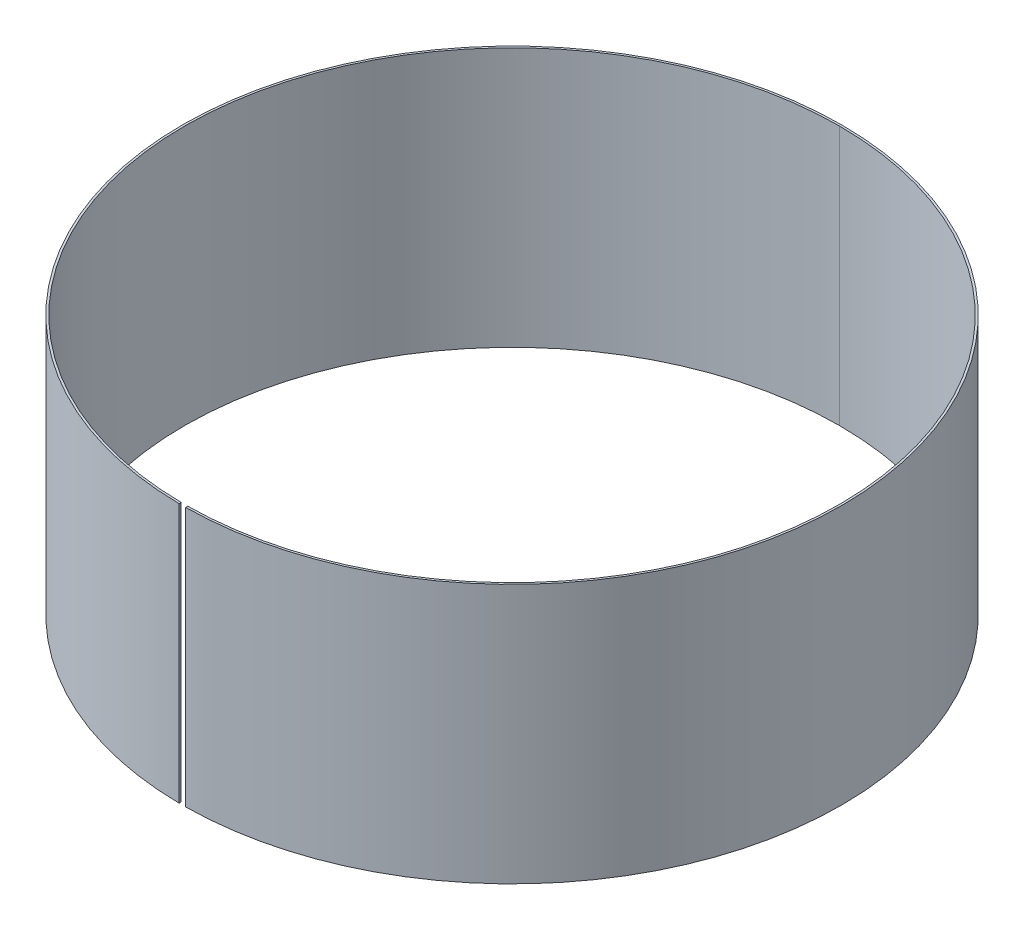
ISO-10303-21;
HEADER;
FILE_DESCRIPTION(('STEP AP214'),'2;1');
FILE_NAME('part.step','',(''),(''),'','','');
FILE_SCHEMA(('AUTOMOTIVE_DESIGN { 1 0 10303 214 1 1 1 1 }'));
ENDSEC;
DATA;
#1=APPLICATION_CONTEXT('core data for automotive mechanical design processes');
#2=APPLICATION_PROTOCOL_DEFINITION('international standard','automotive_design',2000,#1);
#3=PRODUCT_CONTEXT('',#1,'mechanical');
#4=PRODUCT('Part','Part','',(#3));
#5=PRODUCT_RELATED_PRODUCT_CATEGORY('part','',(#4));
#6=PRODUCT_DEFINITION_FORMATION('','',#4);
#7=PRODUCT_DEFINITION_CONTEXT('part definition',#1,'design');
#8=PRODUCT_DEFINITION('design','',#6,#7);
#9=PRODUCT_DEFINITION_SHAPE('','',#8);
#10=(LENGTH_UNIT() NAMED_UNIT(*) SI_UNIT(.MILLI.,.METRE.));
#11=(NAMED_UNIT(*) PLANE_ANGLE_UNIT() SI_UNIT($,.RADIAN.));
#12=(NAMED_UNIT(*) SI_UNIT($,.STERADIAN.) SOLID_ANGLE_UNIT());
#13=UNCERTAINTY_MEASURE_WITH_UNIT(LENGTH_MEASURE(1.E-05),#10,'distance_accuracy_value','');
#14=(GEOMETRIC_REPRESENTATION_CONTEXT(3) GLOBAL_UNCERTAINTY_ASSIGNED_CONTEXT((#13)) GLOBAL_UNIT_ASSIGNED_CONTEXT((#10,
#11,#12)) REPRESENTATION_CONTEXT('',''));
#15=CARTESIAN_POINT('',(0.,0.,0.));
#16=DIRECTION('',(0.,0.,1.));
#17=DIRECTION('',(1.,0.,0.));
#18=AXIS2_PLACEMENT_3D('',#15,#16,#17);
#19=CARTESIAN_POINT('',(0.,198.,0.));
#20=DIRECTION('',(0.,-1.,0.));
#21=DIRECTION('',(0.,0.,-1.));
#22=AXIS2_PLACEMENT_3D('',#19,#20,#21);
#23=CYLINDRICAL_SURFACE('',#22,250.);
#24=CARTESIAN_POINT('',(0.,198.,0.));
#25=DIRECTION('',(0.,1.,0.));
#26=DIRECTION('',(0.,0.,1.));
#27=AXIS2_PLACEMENT_3D('',#24,#25,#26);
#28=CIRCLE('',#27,250.);
#29=CARTESIAN_POINT('',(2.5,198.,249.987499687485));
#30=VERTEX_POINT('',#29);
#31=CARTESIAN_POINT('',(0.,198.,-250.));
#32=VERTEX_POINT('',#31);
#33=EDGE_CURVE('E11',#30,#32,#28,.T.);
#34=ORIENTED_EDGE('',*,*,#33,.T.);
#35=DIRECTION('',(0.,-1.,0.));
#36=VECTOR('',#35,1.);
#37=CARTESIAN_POINT('',(0.,198.,-250.));
#38=LINE('',#37,#36);
#39=CARTESIAN_POINT('',(0.,0.,-250.));
#40=VERTEX_POINT('',#39);
#41=EDGE_CURVE('E27',#32,#40,#38,.T.);
#42=ORIENTED_EDGE('',*,*,#41,.T.);
#43=CARTESIAN_POINT('',(0.,0.,0.));
#44=DIRECTION('',(0.,1.,0.));
#45=DIRECTION('',(0.,0.,1.));
#46=AXIS2_PLACEMENT_3D('',#43,#44,#45);
#47=CIRCLE('',#46,250.);
#48=CARTESIAN_POINT('',(2.5,0.,249.987499687485));
#49=VERTEX_POINT('',#48);
#50=EDGE_CURVE('E127',#49,#40,#47,.T.);
#51=ORIENTED_EDGE('',*,*,#50,.F.);
#52=DIRECTION('',(0.,-1.,0.));
#53=VECTOR('',#52,1.);
#54=CARTESIAN_POINT('',(2.5,198.,249.987499687485));
#55=LINE('',#54,#53);
#56=EDGE_CURVE('E20',#30,#49,#55,.T.);
#57=ORIENTED_EDGE('',*,*,#56,.F.);
#58=EDGE_LOOP('',(#34,#42,#51,#57));
#59=FACE_BOUND('',#58,.T.);
#60=ADVANCED_FACE('F16',(#59),#23,.F.);
#61=CARTESIAN_POINT('',(0.,198.,0.));
#62=DIRECTION('',(0.,-1.,0.));
#63=DIRECTION('',(0.,0.,-1.));
#64=AXIS2_PLACEMENT_3D('',#61,#62,#63);
#65=CYLINDRICAL_SURFACE('',#64,251.6);
#66=CARTESIAN_POINT('',(0.,198.,0.));
#67=DIRECTION('',(0.,1.,0.));
#68=DIRECTION('',(0.,0.,1.));
#69=AXIS2_PLACEMENT_3D('',#66,#67,#68);
#70=CIRCLE('',#69,251.6);
#71=CARTESIAN_POINT('',(0.,198.,-251.6));
#72=VERTEX_POINT('',#71);
#73=CARTESIAN_POINT('',(-2.5,198.,251.587579184665));
#74=VERTEX_POINT('',#73);
#75=EDGE_CURVE('E84',#72,#74,#70,.T.);
#76=ORIENTED_EDGE('',*,*,#75,.F.);
#77=DIRECTION('',(0.,-1.,0.));
#78=VECTOR('',#77,1.);
#79=CARTESIAN_POINT('',(0.,198.,-251.6));
#80=LINE('',#79,#78);
#81=CARTESIAN_POINT('',(0.,0.,-251.6));
#82=VERTEX_POINT('',#81);
#83=EDGE_CURVE('E100',#72,#82,#80,.T.);
#84=ORIENTED_EDGE('',*,*,#83,.T.);
#85=CARTESIAN_POINT('',(0.,0.,0.));
#86=DIRECTION('',(0.,1.,0.));
#87=DIRECTION('',(0.,0.,1.));
#88=AXIS2_PLACEMENT_3D('',#85,#86,#87);
#89=CIRCLE('',#88,251.6);
#90=CARTESIAN_POINT('',(-2.5,0.,251.587579184665));
#91=VERTEX_POINT('',#90);
#92=EDGE_CURVE('E133',#82,#91,#89,.T.);
#93=ORIENTED_EDGE('',*,*,#92,.T.);
#94=DIRECTION('',(0.,1.,0.));
#95=VECTOR('',#94,1.);
#96=CARTESIAN_POINT('',(-2.5,198.,251.587579184665));
#97=LINE('',#96,#95);
#98=EDGE_CURVE('E110',#91,#74,#97,.T.);
#99=ORIENTED_EDGE('',*,*,#98,.T.);
#100=EDGE_LOOP('',(#76,#84,#93,#99));
#101=FACE_BOUND('',#100,.T.);
#102=ADVANCED_FACE('F180',(#101),#65,.T.);
#103=CARTESIAN_POINT('',(0.,198.,0.));
#104=DIRECTION('',(0.,-1.,0.));
#105=DIRECTION('',(0.,0.,-1.));
#106=AXIS2_PLACEMENT_3D('',#103,#104,#105);
#107=CYLINDRICAL_SURFACE('',#106,251.6);
#108=ORIENTED_EDGE('',*,*,#83,.F.);
#109=CARTESIAN_POINT('',(0.,198.,0.));
#110=DIRECTION('',(0.,1.,0.));
#111=DIRECTION('',(0.,0.,1.));
#112=AXIS2_PLACEMENT_3D('',#109,#110,#111);
#113=CIRCLE('',#112,251.6);
#114=CARTESIAN_POINT('',(2.5,198.,251.587579184665));
#115=VERTEX_POINT('',#114);
#116=EDGE_CURVE('E93',#115,#72,#113,.T.);
#117=ORIENTED_EDGE('',*,*,#116,.F.);
#118=DIRECTION('',(0.,-1.,0.));
#119=VECTOR('',#118,1.);
#120=CARTESIAN_POINT('',(2.5,198.,251.587579184665));
#121=LINE('',#120,#119);
#122=CARTESIAN_POINT('',(2.5,0.,251.587579184665));
#123=VERTEX_POINT('',#122);
#124=EDGE_CURVE('E97',#115,#123,#121,.T.);
#125=ORIENTED_EDGE('',*,*,#124,.T.);
#126=CARTESIAN_POINT('',(0.,0.,0.));
#127=DIRECTION('',(0.,1.,0.));
#128=DIRECTION('',(0.,0.,1.));
#129=AXIS2_PLACEMENT_3D('',#126,#127,#128);
#130=CIRCLE('',#129,251.6);
#131=EDGE_CURVE('E111',#123,#82,#130,.T.);
#132=ORIENTED_EDGE('',*,*,#131,.T.);
#133=EDGE_LOOP('',(#108,#117,#125,#132));
#134=FACE_BOUND('',#133,.T.);
#135=ADVANCED_FACE('F95',(#134),#107,.T.);
#136=CARTESIAN_POINT('',(0.,198.,0.));
#137=DIRECTION('',(0.,1.,0.));
#138=DIRECTION('',(1.,0.,0.));
#139=AXIS2_PLACEMENT_3D('',#136,#137,#138);
#140=PLANE('',#139);
#141=DIRECTION('',(0.,0.,1.));
#142=VECTOR('',#141,1.);
#143=CARTESIAN_POINT('',(2.5,198.,255.449352929011));
#144=LINE('',#143,#142);
#145=EDGE_CURVE('E103',#30,#115,#144,.T.);
#146=ORIENTED_EDGE('',*,*,#145,.T.);
#147=ORIENTED_EDGE('',*,*,#116,.T.);
#148=ORIENTED_EDGE('',*,*,#75,.T.);
#149=DIRECTION('',(0.,0.,-1.));
#150=VECTOR('',#149,1.);
#151=CARTESIAN_POINT('',(-2.5,198.,255.449352929011));
#152=LINE('',#151,#150);
#153=CARTESIAN_POINT('',(-2.5,198.,249.987499687485));
#154=VERTEX_POINT('',#153);
#155=EDGE_CURVE('E130',#74,#154,#152,.T.);
#156=ORIENTED_EDGE('',*,*,#155,.T.);
#157=CARTESIAN_POINT('',(0.,198.,0.));
#158=DIRECTION('',(0.,1.,0.));
#159=DIRECTION('',(0.,0.,1.));
#160=AXIS2_PLACEMENT_3D('',#157,#158,#159);
#161=CIRCLE('',#160,250.);
#162=EDGE_CURVE('E153',#32,#154,#161,.T.);
#163=ORIENTED_EDGE('',*,*,#162,.F.);
#164=ORIENTED_EDGE('',*,*,#33,.F.);
#165=EDGE_LOOP('',(#146,#147,#148,#156,#163,#164));
#166=FACE_BOUND('',#165,.T.);
#167=ADVANCED_FACE('F114',(#166),#140,.T.);
#168=CARTESIAN_POINT('',(0.,0.,0.));
#169=DIRECTION('',(0.,1.,0.));
#170=DIRECTION('',(1.,0.,0.));
#171=AXIS2_PLACEMENT_3D('',#168,#169,#170);
#172=PLANE('',#171);
#173=ORIENTED_EDGE('',*,*,#131,.F.);
#174=DIRECTION('',(0.,0.,1.));
#175=VECTOR('',#174,1.);
#176=CARTESIAN_POINT('',(2.5,0.,255.449352929011));
#177=LINE('',#176,#175);
#178=EDGE_CURVE('E108',#49,#123,#177,.T.);
#179=ORIENTED_EDGE('',*,*,#178,.F.);
#180=ORIENTED_EDGE('',*,*,#50,.T.);
#181=CARTESIAN_POINT('',(0.,0.,0.));
#182=DIRECTION('',(0.,1.,0.));
#183=DIRECTION('',(0.,0.,1.));
#184=AXIS2_PLACEMENT_3D('',#181,#182,#183);
#185=CIRCLE('',#184,250.);
#186=CARTESIAN_POINT('',(-2.5,0.,249.987499687485));
#187=VERTEX_POINT('',#186);
#188=EDGE_CURVE('E131',#40,#187,#185,.T.);
#189=ORIENTED_EDGE('',*,*,#188,.T.);
#190=DIRECTION('',(0.,0.,-1.));
#191=VECTOR('',#190,1.);
#192=CARTESIAN_POINT('',(-2.5,0.,255.449352929011));
#193=LINE('',#192,#191);
#194=EDGE_CURVE('E150',#91,#187,#193,.T.);
#195=ORIENTED_EDGE('',*,*,#194,.F.);
#196=ORIENTED_EDGE('',*,*,#92,.F.);
#197=EDGE_LOOP('',(#173,#179,#180,#189,#195,#196));
#198=FACE_BOUND('',#197,.T.);
#199=ADVANCED_FACE('F176',(#198),#172,.F.);
#200=CARTESIAN_POINT('',(0.,198.,0.));
#201=DIRECTION('',(0.,-1.,0.));
#202=DIRECTION('',(0.,0.,-1.));
#203=AXIS2_PLACEMENT_3D('',#200,#201,#202);
#204=CYLINDRICAL_SURFACE('',#203,250.);
#205=ORIENTED_EDGE('',*,*,#41,.F.);
#206=ORIENTED_EDGE('',*,*,#162,.T.);
#207=DIRECTION('',(0.,1.,0.));
#208=VECTOR('',#207,1.);
#209=CARTESIAN_POINT('',(-2.5,198.,249.987499687485));
#210=LINE('',#209,#208);
#211=EDGE_CURVE('E146',#187,#154,#210,.T.);
#212=ORIENTED_EDGE('',*,*,#211,.F.);
#213=ORIENTED_EDGE('',*,*,#188,.F.);
#214=EDGE_LOOP('',(#205,#206,#212,#213));
#215=FACE_BOUND('',#214,.T.);
#216=ADVANCED_FACE('F177',(#215),#204,.F.);
#217=CARTESIAN_POINT('',(-2.5,198.,255.449352929011));
#218=DIRECTION('',(-1.,0.,0.));
#219=DIRECTION('',(0.,0.,1.));
#220=AXIS2_PLACEMENT_3D('',#217,#218,#219);
#221=PLANE('',#220);
#222=ORIENTED_EDGE('',*,*,#194,.T.);
#223=ORIENTED_EDGE('',*,*,#211,.T.);
#224=ORIENTED_EDGE('',*,*,#155,.F.);
#225=ORIENTED_EDGE('',*,*,#98,.F.);
#226=EDGE_LOOP('',(#222,#223,#224,#225));
#227=FACE_BOUND('',#226,.T.);
#228=ADVANCED_FACE('F179',(#227),#221,.F.);
#229=CARTESIAN_POINT('',(2.5,198.,255.449352929011));
#230=DIRECTION('',(1.,0.,0.));
#231=DIRECTION('',(0.,0.,1.));
#232=AXIS2_PLACEMENT_3D('',#229,#230,#231);
#233=PLANE('',#232);
#234=ORIENTED_EDGE('',*,*,#145,.F.);
#235=ORIENTED_EDGE('',*,*,#56,.T.);
#236=ORIENTED_EDGE('',*,*,#178,.T.);
#237=ORIENTED_EDGE('',*,*,#124,.F.);
#238=EDGE_LOOP('',(#234,#235,#236,#237));
#239=FACE_BOUND('',#238,.T.);
#240=ADVANCED_FACE('F18',(#239),#233,.F.);
#241=CLOSED_SHELL('',(#60,#102,#135,#167,#199,#216,#228,#240));
#242=MANIFOLD_SOLID_BREP('B1',#241);
#243=ADVANCED_BREP_SHAPE_REPRESENTATION('',(#18,#242),#14);
#244=SHAPE_DEFINITION_REPRESENTATION(#9,#243);
ENDSEC;
END-ISO-10303-21;
